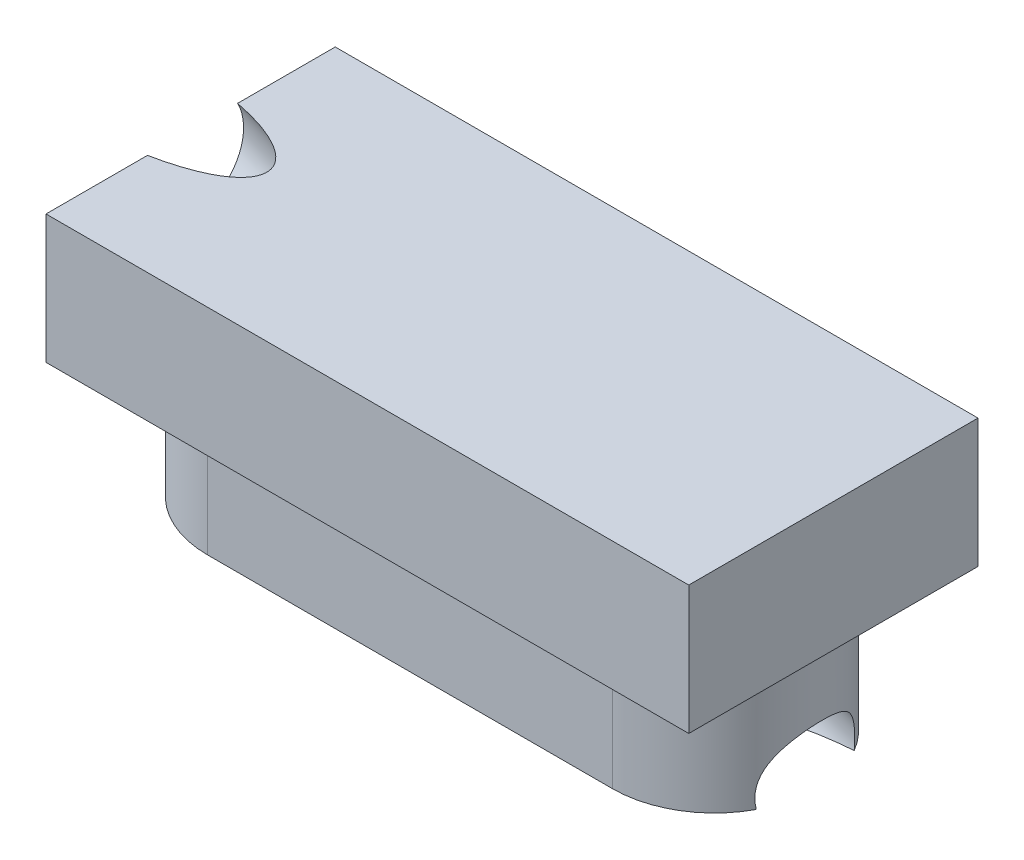
ISO-10303-21;
HEADER;
FILE_DESCRIPTION(('STEP AP214'),'2;1');
FILE_NAME('part.step','',(''),(''),'','','');
FILE_SCHEMA(('AUTOMOTIVE_DESIGN { 1 0 10303 214 1 1 1 1 }'));
ENDSEC;
DATA;
#1=APPLICATION_CONTEXT('core data for automotive mechanical design processes');
#2=APPLICATION_PROTOCOL_DEFINITION('international standard','automotive_design',2000,#1);
#3=PRODUCT_CONTEXT('',#1,'mechanical');
#4=PRODUCT('Part','Part','',(#3));
#5=PRODUCT_RELATED_PRODUCT_CATEGORY('part','',(#4));
#6=PRODUCT_DEFINITION_FORMATION('','',#4);
#7=PRODUCT_DEFINITION_CONTEXT('part definition',#1,'design');
#8=PRODUCT_DEFINITION('design','',#6,#7);
#9=PRODUCT_DEFINITION_SHAPE('','',#8);
#10=(LENGTH_UNIT() NAMED_UNIT(*) SI_UNIT(.MILLI.,.METRE.));
#11=(NAMED_UNIT(*) PLANE_ANGLE_UNIT() SI_UNIT($,.RADIAN.));
#12=(NAMED_UNIT(*) SI_UNIT($,.STERADIAN.) SOLID_ANGLE_UNIT());
#13=UNCERTAINTY_MEASURE_WITH_UNIT(LENGTH_MEASURE(1.E-05),#10,'distance_accuracy_value','');
#14=(GEOMETRIC_REPRESENTATION_CONTEXT(3) GLOBAL_UNCERTAINTY_ASSIGNED_CONTEXT((#13)) GLOBAL_UNIT_ASSIGNED_CONTEXT((#10,
#11,#12)) REPRESENTATION_CONTEXT('',''));
#15=CARTESIAN_POINT('',(0.,0.,0.));
#16=DIRECTION('',(0.,0.,1.));
#17=DIRECTION('',(1.,0.,0.));
#18=AXIS2_PLACEMENT_3D('',#15,#16,#17);
#19=CARTESIAN_POINT('',(1.575,1.,0.0473674614201627));
#20=DIRECTION('',(0.,-1.,0.));
#21=DIRECTION('',(0.,0.,-1.));
#22=AXIS2_PLACEMENT_3D('',#19,#20,#21);
#23=CYLINDRICAL_SURFACE('',#22,0.79375);
#24=CARTESIAN_POINT('',(1.575,0.,0.0473674614201627));
#25=DIRECTION('',(0.,1.,0.));
#26=DIRECTION('',(0.,0.,1.));
#27=AXIS2_PLACEMENT_3D('',#24,#25,#26);
#28=CIRCLE('',#27,0.79375);
#29=CARTESIAN_POINT('',(2.27480655811766,0.,0.421947017343213));
#30=VERTEX_POINT('',#29);
#31=CARTESIAN_POINT('',(1.575,0.,0.841117461420163));
#32=VERTEX_POINT('',#31);
#33=EDGE_CURVE('E162',#30,#32,#28,.F.);
#34=ORIENTED_EDGE('',*,*,#33,.F.);
#35=CARTESIAN_POINT('',(2.27480655811767,0.,0.421947017343207));
#36=CARTESIAN_POINT('',(2.27290475913481,0.0187473128209449,0.42546143543055));
#37=CARTESIAN_POINT('',(2.27166349827804,0.037837291086776,0.427751535409357));
#38=CARTESIAN_POINT('',(2.27064446657195,0.0760438339837114,0.429633152383738));
#39=CARTESIAN_POINT('',(2.27085623642141,0.0951592203780479,0.42924395560214));
#40=CARTESIAN_POINT('',(2.27281131817616,0.132224902451338,0.425653574423875));
#41=CARTESIAN_POINT('',(2.2744881394751,0.150189877215529,0.422574470799065));
#42=CARTESIAN_POINT('',(2.27917356866453,0.185279366072017,0.413706175278667));
#43=CARTESIAN_POINT('',(2.28218369161929,0.202402899351118,0.407913899905822));
#44=CARTESIAN_POINT('',(2.28921393924687,0.235204365328227,0.393775785385924));
#45=CARTESIAN_POINT('',(2.29322788057111,0.250890372928903,0.385445513688793));
#46=CARTESIAN_POINT('',(2.30185345468241,0.280582662940252,0.366477498835634));
#47=CARTESIAN_POINT('',(2.30646454559633,0.294590446307638,0.355841841837072));
#48=CARTESIAN_POINT('',(2.31604451225465,0.321297685499104,0.332082402719911));
#49=CARTESIAN_POINT('',(2.32102029434606,0.3339186939115,0.318873663185869));
#50=CARTESIAN_POINT('',(2.33074604280964,0.357164317092347,0.290501073022927));
#51=CARTESIAN_POINT('',(2.33549327265475,0.367767838674795,0.275319092130322));
#52=CARTESIAN_POINT('',(2.34432576997775,0.386782893190754,0.243455860933043));
#53=CARTESIAN_POINT('',(2.34841059952855,0.395192978212891,0.226773630017191));
#54=CARTESIAN_POINT('',(2.35617095933561,0.410926165070049,0.189581711996557));
#55=CARTESIAN_POINT('',(2.35968448179174,0.417877787828919,0.168879904268659));
#56=CARTESIAN_POINT('',(2.36508418544465,0.428788316687565,0.126503703248674));
#57=CARTESIAN_POINT('',(2.36697044541866,0.432747367659269,0.10482935709149));
#58=CARTESIAN_POINT('',(2.36893403090621,0.437661977984487,0.061062026989856));
#59=CARTESIAN_POINT('',(2.36901138124383,0.438617578554883,0.0389690487945532));
#60=CARTESIAN_POINT('',(2.36732247806588,0.437526045011168,-0.00507109503252541));
#61=CARTESIAN_POINT('',(2.36555624069689,0.435478937195425,-0.0270182619396568));
#62=CARTESIAN_POINT('',(2.36029449591995,0.428397072163708,-0.070212192056974));
#63=CARTESIAN_POINT('',(2.35679898812197,0.423362314273887,-0.0914589551091869));
#64=CARTESIAN_POINT('',(2.34833851499657,0.410325971685298,-0.132716135062642));
#65=CARTESIAN_POINT('',(2.34337348048279,0.402324247295152,-0.152726493699456));
#66=CARTESIAN_POINT('',(2.33237741956,0.383370408374989,-0.190990908106002));
#67=CARTESIAN_POINT('',(2.326346218966,0.372417811592376,-0.20924467613882));
#68=CARTESIAN_POINT('',(2.31410789388113,0.348243596727161,-0.242558303099579));
#69=CARTESIAN_POINT('',(2.30792665673789,0.335171407997486,-0.257735574228023));
#70=CARTESIAN_POINT('',(2.29615039812182,0.307496190639898,-0.284567387189491));
#71=CARTESIAN_POINT('',(2.29054482363793,0.293066681743654,-0.296395101416329));
#72=CARTESIAN_POINT('',(2.28038693915799,0.263218737036272,-0.316761012064746));
#73=CARTESIAN_POINT('',(2.27578933662254,0.247930252087437,-0.325465878091827));
#74=CARTESIAN_POINT('',(2.26778424798577,0.216351818914873,-0.340133956697702));
#75=CARTESIAN_POINT('',(2.26434669172017,0.200102601272871,-0.346167960680717));
#76=CARTESIAN_POINT('',(2.25881134899761,0.166641613912717,-0.355710728113688));
#77=CARTESIAN_POINT('',(2.25671499581061,0.149428835773699,-0.35921679059783));
#78=CARTESIAN_POINT('',(2.25401359167783,0.114623360421782,-0.363712008400114));
#79=CARTESIAN_POINT('',(2.25340422446174,0.0970319126937199,-0.364708448663265));
#80=CARTESIAN_POINT('',(2.25360615723677,0.0618990818263485,-0.364376435078818));
#81=CARTESIAN_POINT('',(2.25441676902625,0.0443576785594358,-0.363049107459924));
#82=CARTESIAN_POINT('',(2.25657688879684,0.0179482410185388,-0.359440764019642));
#83=CARTESIAN_POINT('',(2.25748501253244,0.0089335308918141,-0.357916482100452));
#84=CARTESIAN_POINT('',(2.25854479429263,0.,-0.356124269220565));
#85=B_SPLINE_CURVE_WITH_KNOTS('',3,(#35,#36,#37,#38,#39,#40,#41,#42,#43,#44,#45,#46,#47,#48,#49,
#50,#51,#52,#53,#54,#55,#56,#57,#58,#59,#60,#61,#62,#63,#64,#65,#66,#67,#68,#69,#70,#71,#72,#73,
#74,#75,#76,#77,#78,#79,#80,#81,#82,#83,#84),.UNSPECIFIED.,.F.,.F.,(4,2,2,2,2,2,2,2,2,2,2,2,2,2,
2,2,2,2,2,2,2,2,2,2,4),(0.,0.0575237540739679,0.114633873503813,0.169279312924329,
0.223987007273612,0.27836567242222,0.332695333890509,0.38928026802939,0.446427707580151,
0.503612775842374,0.569676140400476,0.635736306592478,0.701795566225118,0.767854247299928,
0.83391294327386,0.899974749833041,0.966047359239181,1.02864888352726,1.08682544071129,
1.14112573312651,1.19388511875639,1.24670079167714,1.2993629733478,1.35199963902641,
1.37953290455163),.UNSPECIFIED.);
#86=CARTESIAN_POINT('',(2.25854479428757,0.,-0.356124269220179));
#87=VERTEX_POINT('',#86);
#88=EDGE_CURVE('E54',#30,#87,#85,.T.);
#89=ORIENTED_EDGE('',*,*,#88,.T.);
#90=CARTESIAN_POINT('',(1.575,0.,-0.746382538579837));
#91=VERTEX_POINT('',#90);
#92=EDGE_CURVE('E176',#91,#87,#28,.F.);
#93=ORIENTED_EDGE('',*,*,#92,.F.);
#94=DIRECTION('',(0.,-1.,0.));
#95=VECTOR('',#94,1.);
#96=CARTESIAN_POINT('',(1.575,1.,-0.746382538579837));
#97=LINE('',#96,#95);
#98=CARTESIAN_POINT('',(1.575,1.,-0.746382538579837));
#99=VERTEX_POINT('',#98);
#100=EDGE_CURVE('E48',#99,#91,#97,.T.);
#101=ORIENTED_EDGE('',*,*,#100,.F.);
#102=CARTESIAN_POINT('',(1.575,1.,0.0473674614201627));
#103=DIRECTION('',(0.,1.,0.));
#104=DIRECTION('',(0.,0.,1.));
#105=AXIS2_PLACEMENT_3D('',#102,#103,#104);
#106=CIRCLE('',#105,0.79375);
#107=CARTESIAN_POINT('',(1.575,1.,0.841117461420163));
#108=VERTEX_POINT('',#107);
#109=EDGE_CURVE('E163',#99,#108,#106,.F.);
#110=ORIENTED_EDGE('',*,*,#109,.T.);
#111=DIRECTION('',(0.,-1.,0.));
#112=VECTOR('',#111,1.);
#113=CARTESIAN_POINT('',(1.575,1.,0.841117461420163));
#114=LINE('',#113,#112);
#115=EDGE_CURVE('E175',#108,#32,#114,.T.);
#116=ORIENTED_EDGE('',*,*,#115,.T.);
#117=EDGE_LOOP('',(#34,#89,#93,#101,#110,#116));
#118=FACE_BOUND('',#117,.T.);
#119=ADVANCED_FACE('F35',(#118),#23,.T.);
#120=CARTESIAN_POINT('',(0.,0.,0.));
#121=DIRECTION('',(0.,1.,0.));
#122=DIRECTION('',(0.,0.,1.));
#123=AXIS2_PLACEMENT_3D('',#120,#121,#122);
#124=PLANE('',#123);
#125=CARTESIAN_POINT('',(2.397175,0.,0.427982148555704));
#126=CARTESIAN_POINT('',(2.36796450905351,1.22261529916144E-13,0.427148748386135));
#127=CARTESIAN_POINT('',(2.33876709555136,0.,0.425889056421551));
#128=CARTESIAN_POINT('',(2.28042382861932,0.,0.42248610742621));
#129=CARTESIAN_POINT('',(2.25127797543482,-1.19226931686685E-13,0.420342846201577));
#130=CARTESIAN_POINT('',(2.16395771990467,2.65769411504817E-13,0.412541382305574));
#131=CARTESIAN_POINT('',(2.10589917447937,1.27115009376972E-12,0.405511461259729));
#132=CARTESIAN_POINT('',(1.99039801853805,1.25287044279439E-12,0.387279404692884));
#133=CARTESIAN_POINT('',(1.93295555409935,2.2873914278021E-13,0.376076301236728));
#134=CARTESIAN_POINT('',(1.84774408472115,-1.1439148879792E-13,0.355335256521259));
#135=CARTESIAN_POINT('',(1.81949630588881,0.,0.347764596220603));
#136=CARTESIAN_POINT('',(1.76341566469524,0.,0.331056376802049));
#137=CARTESIAN_POINT('',(1.73558355854756,0.,0.321916269014761));
#138=CARTESIAN_POINT('',(1.67528740346927,0.,0.299803934787368));
#139=CARTESIAN_POINT('',(1.64296301083421,0.,0.286432726107921));
#140=CARTESIAN_POINT('',(1.59582924658378,0.,0.263672164128355));
#141=CARTESIAN_POINT('',(1.58036191787709,0.,0.255646375204926));
#142=CARTESIAN_POINT('',(1.55004974499418,0.,0.238502922641947));
#143=CARTESIAN_POINT('',(1.53520441089752,0.,0.229386141024679));
#144=CARTESIAN_POINT('',(1.50883821786853,0.,0.211456138966348));
#145=CARTESIAN_POINT('',(1.49717809835545,0.,0.202849657494356));
#146=CARTESIAN_POINT('',(1.4747761204113,0.,0.184528779307087));
#147=CARTESIAN_POINT('',(1.46403282714351,0.,0.174816171449245));
#148=CARTESIAN_POINT('',(1.44373017543517,0.,0.153888599315258));
#149=CARTESIAN_POINT('',(1.43419267750807,0.,0.142651953515073));
#150=CARTESIAN_POINT('',(1.4173285857979,0.,0.118627559437801));
#151=CARTESIAN_POINT('',(1.4099912996645,0.,0.105847750360428));
#152=CARTESIAN_POINT('',(1.40099049662917,0.,0.084446300698651));
#153=CARTESIAN_POINT('',(1.39823517303411,0.,0.0762862878502934));
#154=CARTESIAN_POINT('',(1.39410918509456,0.,0.0596222678233482));
#155=CARTESIAN_POINT('',(1.39273703491933,0.,0.0511186400013119));
#156=CARTESIAN_POINT('',(1.39152069159979,0.,0.0339668102469565));
#157=CARTESIAN_POINT('',(1.39168240773919,0.,0.0253181774250572));
#158=CARTESIAN_POINT('',(1.39352842668226,0.,0.00818487111951891));
#159=CARTESIAN_POINT('',(1.39521373866125,0.,-0.000299689883744412));
#160=CARTESIAN_POINT('',(1.40039100091115,0.,-0.0184865334547723));
#161=CARTESIAN_POINT('',(1.40416985780337,0.,-0.0281060038313774));
#162=CARTESIAN_POINT('',(1.41323504048155,0.,-0.0466168430313317));
#163=CARTESIAN_POINT('',(1.41852602213019,0.,-0.0555058521967729));
#164=CARTESIAN_POINT('',(1.43365766862999,0.,-0.0775236335558731));
#165=CARTESIAN_POINT('',(1.44434239938719,0.,-0.0900653059893747));
#166=CARTESIAN_POINT('',(1.46740567209993,0.,-0.113456405047001));
#167=CARTESIAN_POINT('',(1.4797883022293,0.,-0.124301607746966));
#168=CARTESIAN_POINT('',(1.50584008538746,0.,-0.144776143042538));
#169=CARTESIAN_POINT('',(1.51952720890731,0.,-0.15438225619172));
#170=CARTESIAN_POINT('',(1.54764835541335,0.,-0.172435968268907));
#171=CARTESIAN_POINT('',(1.56208301132673,0.,-0.180882562605807));
#172=CARTESIAN_POINT('',(1.60290294776473,0.,-0.203025264481425));
#173=CARTESIAN_POINT('',(1.62984517150922,0.,-0.215690219036646));
#174=CARTESIAN_POINT('',(1.68468393348453,0.,-0.238774525928359));
#175=CARTESIAN_POINT('',(1.71258168045355,0.,-0.249190902355673));
#176=CARTESIAN_POINT('',(1.76886155761681,0.,-0.26818383683754));
#177=CARTESIAN_POINT('',(1.79724119619544,-1.23161900021388E-13,-0.276767853084089));
#178=CARTESIAN_POINT('',(1.8544071521976,1.23182195769169E-13,-0.292450806293291));
#179=CARTESIAN_POINT('',(1.88319353586673,4.59749948492913E-13,-0.299549498297851));
#180=CARTESIAN_POINT('',(1.94101743622911,-4.59227081577878E-13,-0.312456375212231));
#181=CARTESIAN_POINT('',(1.9700546300796,-1.71296161331548E-12,-0.318266018615382));
#182=CARTESIAN_POINT('',(2.02834156862742,1.71353121327408E-12,-0.328745808934497));
#183=CARTESIAN_POINT('',(2.0575913807922,6.39573189189326E-12,-0.333415576298739));
#184=CARTESIAN_POINT('',(2.13833274038069,1.10641133346742E-11,-0.344850382083459));
#185=CARTESIAN_POINT('',(2.18997708684558,4.85378419241907E-12,-0.350543023298893));
#186=CARTESIAN_POINT('',(2.29346825874897,-4.85028210048234E-12,-0.359038510049044));
#187=CARTESIAN_POINT('',(2.34531491120986,-8.34597608771984E-12,-0.361843437659409));
#188=CARTESIAN_POINT('',(2.39717499999997,0.,-0.363352699933463));
#189=B_SPLINE_CURVE_WITH_KNOTS('',3,(#125,#126,#127,#128,#129,#130,#131,#132,#133,#134,#135,
#136,#137,#138,#139,#140,#141,#142,#143,#144,#145,#146,#147,#148,#149,#150,#151,#152,#153,#154,
#155,#156,#157,#158,#159,#160,#161,#162,#163,#164,#165,#166,#167,#168,#169,#170,#171,#172,#173,
#174,#175,#176,#177,#178,#179,#180,#181,#182,#183,#184,#185,#186,#187,#188),.UNSPECIFIED.,.F.,
.F.,(4,2,2,2,2,2,2,2,2,2,2,2,2,2,2,2,2,2,2,2,2,2,2,2,2,2,2,2,2,2,2,4),(0.,0.0876616337968697,
0.175323683685893,0.350643448242562,0.526003902114552,0.613700931800332,0.701541745794205,
0.80629122044717,0.85853577339582,0.910738370573763,0.954162892305812,0.9975181581401,
1.0415718516331,1.0854078525895,1.11114567055511,1.13685581091737,1.16266504077312,
1.18849137827357,1.21932460239899,1.25025380478336,1.29940296857978,1.34867262183036,
1.39876163600688,1.44889377636192,1.53804577394707,1.62731504716085,1.71621373366166,
1.80512706970359,1.89393928590445,1.98278103425261,2.13856263680734,2.29423184015507),.UNSPECIFIED.);
#190=EDGE_CURVE('E124',#30,#87,#189,.T.);
#191=ORIENTED_EDGE('',*,*,#190,.F.);
#192=ORIENTED_EDGE('',*,*,#33,.T.);
#193=DIRECTION('',(1.,0.,0.));
#194=VECTOR('',#193,1.);
#195=CARTESIAN_POINT('',(0.,0.,0.841117461420163));
#196=LINE('',#195,#194);
#197=CARTESIAN_POINT('',(-1.575,0.,0.841117461420163));
#198=VERTEX_POINT('',#197);
#199=EDGE_CURVE('E166',#198,#32,#196,.T.);
#200=ORIENTED_EDGE('',*,*,#199,.F.);
#201=CARTESIAN_POINT('',(-1.575,0.,0.0473674614201627));
#202=DIRECTION('',(0.,1.,0.));
#203=DIRECTION('',(0.,0.,1.));
#204=AXIS2_PLACEMENT_3D('',#201,#202,#203);
#205=CIRCLE('',#204,0.79375);
#206=CARTESIAN_POINT('',(-1.575,0.,-0.746382538579837));
#207=VERTEX_POINT('',#206);
#208=EDGE_CURVE('E182',#198,#207,#205,.F.);
#209=ORIENTED_EDGE('',*,*,#208,.T.);
#210=DIRECTION('',(1.,0.,0.));
#211=VECTOR('',#210,1.);
#212=CARTESIAN_POINT('',(0.,0.,-0.746382538579837));
#213=LINE('',#212,#211);
#214=EDGE_CURVE('E179',#207,#91,#213,.T.);
#215=ORIENTED_EDGE('',*,*,#214,.T.);
#216=ORIENTED_EDGE('',*,*,#92,.T.);
#217=EDGE_LOOP('',(#191,#192,#200,#209,#215,#216));
#218=FACE_BOUND('',#217,.T.);
#219=ADVANCED_FACE('F201',(#218),#124,.F.);
#220=CARTESIAN_POINT('',(-2.5,2.,-1.07763253857984));
#221=DIRECTION('',(1.,0.,0.));
#222=DIRECTION('',(0.,0.,-1.));
#223=AXIS2_PLACEMENT_3D('',#220,#221,#222);
#224=PLANE('',#223);
#225=CARTESIAN_POINT('',(-2.5,2.,-0.317936772964535));
#226=CARTESIAN_POINT('',(-2.5,1.98059400012431,-0.328297893178377));
#227=CARTESIAN_POINT('',(-2.5,1.96031609395947,-0.337011695009106));
#228=CARTESIAN_POINT('',(-2.5,1.91860097923725,-0.350979581708868));
#229=CARTESIAN_POINT('',(-2.5,1.89716377067987,-0.3562336665779));
#230=CARTESIAN_POINT('',(-2.5,1.85371456135836,-0.363117039158797));
#231=CARTESIAN_POINT('',(-2.5,1.83170256059423,-0.364746326870662));
#232=CARTESIAN_POINT('',(-2.5,1.78771269830616,-0.364340570471703));
#233=CARTESIAN_POINT('',(-2.5,1.76573483678222,-0.362305526360879));
#234=CARTESIAN_POINT('',(-2.5,1.72241894710352,-0.354625787786488));
#235=CARTESIAN_POINT('',(-2.5,1.70108091894876,-0.348981093322922));
#236=CARTESIAN_POINT('',(-2.5,1.65963335779808,-0.334238130322301));
#237=CARTESIAN_POINT('',(-2.5,1.63952382480217,-0.325139861785246));
#238=CARTESIAN_POINT('',(-2.5,1.60108786736927,-0.303740589292517));
#239=CARTESIAN_POINT('',(-2.5,1.58276144293227,-0.291439585336842));
#240=CARTESIAN_POINT('',(-2.5,1.54839717962613,-0.263974148255288));
#241=CARTESIAN_POINT('',(-2.5,1.53235934075698,-0.248809715129407));
#242=CARTESIAN_POINT('',(-2.5,1.50301459146342,-0.216035667905357));
#243=CARTESIAN_POINT('',(-2.5,1.48970768103901,-0.198426053807187));
#244=CARTESIAN_POINT('',(-2.5,1.46619181196707,-0.161247343711466));
#245=CARTESIAN_POINT('',(-2.5,1.45598285331954,-0.141678247713914));
#246=CARTESIAN_POINT('',(-2.5,1.43894446456698,-0.101120315528838));
#247=CARTESIAN_POINT('',(-2.5,1.43211503446196,-0.0801314793413135));
#248=CARTESIAN_POINT('',(-2.5,1.42202406779837,-0.0373129675276175));
#249=CARTESIAN_POINT('',(-2.5,1.4187625312398,-0.015483291901446));
#250=CARTESIAN_POINT('',(-2.5,1.41589730927084,0.0284148067260627));
#251=CARTESIAN_POINT('',(-2.5,1.41629362386045,0.0504832297273999));
#252=CARTESIAN_POINT('',(-2.5,1.42073317327167,0.0942501460180027));
#253=CARTESIAN_POINT('',(-2.5,1.42477640809329,0.115948639307268));
#254=CARTESIAN_POINT('',(-2.5,1.43639828015317,0.158377222256411));
#255=CARTESIAN_POINT('',(-2.5,1.44397691739143,0.179107311916287));
#256=CARTESIAN_POINT('',(-2.5,1.46246056482905,0.219027323599381));
#257=CARTESIAN_POINT('',(-2.5,1.47336557502841,0.238217245622599));
#258=CARTESIAN_POINT('',(-2.5,1.49820119469471,0.274527637843366));
#259=CARTESIAN_POINT('',(-2.5,1.51213180416166,0.291648108040916));
#260=CARTESIAN_POINT('',(-2.5,1.54263439238862,0.32334739107827));
#261=CARTESIAN_POINT('',(-2.5,1.55920637114862,0.337926203918073));
#262=CARTESIAN_POINT('',(-2.5,1.59453463836486,0.364140067706757));
#263=CARTESIAN_POINT('',(-2.5,1.6132909268211,0.375775118655638));
#264=CARTESIAN_POINT('',(-2.5,1.65247042202832,0.395780552167141));
#265=CARTESIAN_POINT('',(-2.5,1.6728936287793,0.404150934729763));
#266=CARTESIAN_POINT('',(-2.5,1.71484391268046,0.417396149976966));
#267=CARTESIAN_POINT('',(-2.5,1.73637098983063,0.422270982661547));
#268=CARTESIAN_POINT('',(-2.5,1.77993432846075,0.428390699524808));
#269=CARTESIAN_POINT('',(-2.5,1.80197058994069,0.429635583703489));
#270=CARTESIAN_POINT('',(-2.5,1.8459480155054,0.428460859417944));
#271=CARTESIAN_POINT('',(-2.5,1.86788917959017,0.426041250953718));
#272=CARTESIAN_POINT('',(-2.5,1.90851904556333,0.418101254330287));
#273=CARTESIAN_POINT('',(-2.5,1.92728672795575,0.412979111234722));
#274=CARTESIAN_POINT('',(-2.5,1.9642847454032,0.399911928975123));
#275=CARTESIAN_POINT('',(-2.5,1.98249373508707,0.39190643066596));
#276=CARTESIAN_POINT('',(-2.5,1.99999999999999,0.382566221586777));
#277=B_SPLINE_CURVE_WITH_KNOTS('',3,(#225,#226,#227,#228,#229,#230,#231,#232,#233,#234,#235,
#236,#237,#238,#239,#240,#241,#242,#243,#244,#245,#246,#247,#248,#249,#250,#251,#252,#253,#254,
#255,#256,#257,#258,#259,#260,#261,#262,#263,#264,#265,#266,#267,#268,#269,#270,#271,#272,#273,
#274,#275,#276),.UNSPECIFIED.,.F.,.F.,(4,2,2,2,2,2,2,2,2,2,2,2,2,2,2,2,2,2,2,2,2,2,2,2,2,4),(0.,
0.0659115563194932,0.131823112638985,0.197734668958477,0.263646225277969,0.329557781597461,
0.395469337916953,0.461380894236445,0.527292450555936,0.593204006875428,0.65911556319492,
0.725027119514411,0.790938675833903,0.856850232153395,0.922761788472886,0.988673344792378,
1.05458490111187,1.12049645743136,1.18640801375085,1.25231957007034,1.31823112638984,
1.38414268270933,1.45005423902882,1.51596579534831,1.57412380409808,1.6335799862812),.UNSPECIFIED.);
#278=CARTESIAN_POINT('',(-2.5,2.,-0.317936772964535));
#279=VERTEX_POINT('',#278);
#280=CARTESIAN_POINT('',(-2.5,2.,0.382566221591575));
#281=VERTEX_POINT('',#280);
#282=EDGE_CURVE('E61',#279,#281,#277,.T.);
#283=ORIENTED_EDGE('',*,*,#282,.F.);
#284=DIRECTION('',(0.,0.,1.));
#285=VECTOR('',#284,1.);
#286=CARTESIAN_POINT('',(-2.5,2.,-1.07763253857984));
#287=LINE('',#286,#285);
#288=CARTESIAN_POINT('',(-2.5,2.,-1.07763253857984));
#289=VERTEX_POINT('',#288);
#290=EDGE_CURVE('E121',#289,#279,#287,.T.);
#291=ORIENTED_EDGE('',*,*,#290,.F.);
#292=DIRECTION('',(0.,-1.,0.));
#293=VECTOR('',#292,1.);
#294=CARTESIAN_POINT('',(-2.5,2.,-1.07763253857984));
#295=LINE('',#294,#293);
#296=CARTESIAN_POINT('',(-2.5,1.,-1.07763253857984));
#297=VERTEX_POINT('',#296);
#298=EDGE_CURVE('E143',#289,#297,#295,.T.);
#299=ORIENTED_EDGE('',*,*,#298,.T.);
#300=DIRECTION('',(0.,0.,1.));
#301=VECTOR('',#300,1.);
#302=CARTESIAN_POINT('',(-2.5,1.,-1.07763253857984));
#303=LINE('',#302,#301);
#304=CARTESIAN_POINT('',(-2.5,1.,1.17236746142016));
#305=VERTEX_POINT('',#304);
#306=EDGE_CURVE('E144',#297,#305,#303,.T.);
#307=ORIENTED_EDGE('',*,*,#306,.T.);
#308=DIRECTION('',(0.,-1.,0.));
#309=VECTOR('',#308,1.);
#310=CARTESIAN_POINT('',(-2.5,2.,1.17236746142016));
#311=LINE('',#310,#309);
#312=CARTESIAN_POINT('',(-2.5,2.,1.17236746142016));
#313=VERTEX_POINT('',#312);
#314=EDGE_CURVE('E159',#313,#305,#311,.T.);
#315=ORIENTED_EDGE('',*,*,#314,.F.);
#316=EDGE_CURVE('E123',#281,#313,#287,.T.);
#317=ORIENTED_EDGE('',*,*,#316,.F.);
#318=EDGE_LOOP('',(#283,#291,#299,#307,#315,#317));
#319=FACE_BOUND('',#318,.T.);
#320=ADVANCED_FACE('F119',(#319),#224,.F.);
#321=CARTESIAN_POINT('',(0.,2.,0.));
#322=DIRECTION('',(0.,1.,0.));
#323=DIRECTION('',(0.,0.,1.));
#324=AXIS2_PLACEMENT_3D('',#321,#322,#323);
#325=PLANE('',#324);
#326=ORIENTED_EDGE('',*,*,#290,.T.);
#327=CARTESIAN_POINT('',(-2.5,2.,-0.317936772964535));
#328=CARTESIAN_POINT('',(-2.47127729535429,2.,-0.312357588162685));
#329=CARTESIAN_POINT('',(-2.44266563125951,2.,-0.30621712707801));
#330=CARTESIAN_POINT('',(-2.38578661849369,2.,-0.292623503689121));
#331=CARTESIAN_POINT('',(-2.35751896544523,2.,-0.285171608166973));
#332=CARTESIAN_POINT('',(-2.2841892239013,2.,-0.263722336655962));
#333=CARTESIAN_POINT('',(-2.23945637582542,1.99999999999999,-0.248513080223905));
#334=CARTESIAN_POINT('',(-2.16774008633411,2.00000000000001,-0.218974357714848));
#335=CARTESIAN_POINT('',(-2.14009789735838,2.00000000000002,-0.206252733236482));
#336=CARTESIAN_POINT('',(-2.08642732548051,1.99999999999998,-0.177759668939709));
#337=CARTESIAN_POINT('',(-2.06039510753733,1.99999999999994,-0.161995876835474));
#338=CARTESIAN_POINT('',(-2.02442408501774,1.99999999999997,-0.135579621193512));
#339=CARTESIAN_POINT('',(-2.01325564908913,1.99999999999999,-0.126633511189538));
#340=CARTESIAN_POINT('',(-1.99196954524506,2.00000000000001,-0.107582070602844));
#341=CARTESIAN_POINT('',(-1.98185247501711,2.,-0.0974760874426464));
#342=CARTESIAN_POINT('',(-1.95705072751683,2.,-0.0687099256903317));
#343=CARTESIAN_POINT('',(-1.94365324928329,2.,-0.048749538622725));
#344=CARTESIAN_POINT('',(-1.93131005139871,2.,-0.0190151209528794));
#345=CARTESIAN_POINT('',(-1.92858826410927,2.,-0.0108129860102212));
#346=CARTESIAN_POINT('',(-1.92454625779649,2.,0.00593051395953294));
#347=CARTESIAN_POINT('',(-1.92322443918998,2.,0.0144714802368244));
#348=CARTESIAN_POINT('',(-1.9221220114003,2.,0.0316865913453196));
#349=CARTESIAN_POINT('',(-1.92234709612814,2.00000000000001,0.0403611108060153));
#350=CARTESIAN_POINT('',(-1.92432490768219,1.99999999999999,0.0575348316649135));
#351=CARTESIAN_POINT('',(-1.92607879497096,1.99999999999995,0.066033894862259));
#352=CARTESIAN_POINT('',(-1.9314164021547,1.99999999999994,0.0842815233120808));
#353=CARTESIAN_POINT('',(-1.9352944805615,1.99999999999998,0.0939427749181369));
#354=CARTESIAN_POINT('',(-1.94456089041985,2.00000000000002,0.112522440596315));
#355=CARTESIAN_POINT('',(-1.94995394535586,2.00000000000001,0.121438416341535));
#356=CARTESIAN_POINT('',(-1.96539798863781,1.99999999999999,0.143586733466623));
#357=CARTESIAN_POINT('',(-1.9763064249225,2.,0.156213934410769));
#358=CARTESIAN_POINT('',(-1.99982864633503,2.,0.179754216694935));
#359=CARTESIAN_POINT('',(-2.01244746471138,2.,0.190662025244814));
#360=CARTESIAN_POINT('',(-2.03917679554346,2.,0.211398983027432));
#361=CARTESIAN_POINT('',(-2.05332201283921,2.,0.221182724215826));
#362=CARTESIAN_POINT('',(-2.08237749953529,2.,0.239545602315389));
#363=CARTESIAN_POINT('',(-2.09728847357608,2.00000000000001,0.248123601581907));
#364=CARTESIAN_POINT('',(-2.14283357411209,1.99999999999999,0.272395171466601));
#365=CARTESIAN_POINT('',(-2.17425490326738,1.99999999999993,0.286608534120867));
#366=CARTESIAN_POINT('',(-2.22979486437923,2.00000000000004,0.308817190840672));
#367=CARTESIAN_POINT('',(-2.25366671972914,2.00000000000016,0.317465526420381));
#368=CARTESIAN_POINT('',(-2.30179745417342,1.99999999999984,0.333453603045437));
#369=CARTESIAN_POINT('',(-2.32605553120426,1.9999999999994,0.340795747116761));
#370=CARTESIAN_POINT('',(-2.37511488946673,2.0000000000006,0.354449226489593));
#371=CARTESIAN_POINT('',(-2.39991917321888,2.00000000000225,0.360749592896928));
#372=CARTESIAN_POINT('',(-2.44978926639505,1.99999999999775,0.372366649740822));
#373=CARTESIAN_POINT('',(-2.47485535295878,1.99999999999158,0.377682155501469));
#374=CARTESIAN_POINT('',(-2.49999999999254,1.99999999997654,0.382566221591575));
#375=B_SPLINE_CURVE_WITH_KNOTS('',3,(#327,#328,#329,#330,#331,#332,#333,#334,#335,#336,#337,
#338,#339,#340,#341,#342,#343,#344,#345,#346,#347,#348,#349,#350,#351,#352,#353,#354,#355,#356,
#357,#358,#359,#360,#361,#362,#363,#364,#365,#366,#367,#368,#369,#370,#371,#372,#373,#374),
.UNSPECIFIED.,.F.,.F.,(4,2,2,2,2,2,2,2,2,2,2,2,2,2,2,2,2,2,2,2,2,2,2,4),(0.,0.0877637889365405,
0.175443263022218,0.316880667414951,0.408059042315635,0.499011121183926,0.541858271794959,
0.584729648708066,0.655375706608949,0.681200192342079,0.706995139468823,0.732885084511163,
0.758794698869592,0.789852947163894,0.821009126508685,0.87078657718109,0.920713827015326,
0.972230911182377,1.02379628120619,1.12701819784221,1.20315999101428,1.2791602224938,
1.35591571703465,1.43276294868972),.UNSPECIFIED.);
#376=EDGE_CURVE('E11',#279,#281,#375,.T.);
#377=ORIENTED_EDGE('',*,*,#376,.T.);
#378=ORIENTED_EDGE('',*,*,#316,.T.);
#379=DIRECTION('',(1.,0.,0.));
#380=VECTOR('',#379,1.);
#381=CARTESIAN_POINT('',(-2.5,2.,1.17236746142016));
#382=LINE('',#381,#380);
#383=CARTESIAN_POINT('',(2.5,2.,1.17236746142016));
#384=VERTEX_POINT('',#383);
#385=EDGE_CURVE('E130',#313,#384,#382,.T.);
#386=ORIENTED_EDGE('',*,*,#385,.T.);
#387=DIRECTION('',(0.,0.,-1.));
#388=VECTOR('',#387,1.);
#389=CARTESIAN_POINT('',(2.5,2.,-1.07763253857984));
#390=LINE('',#389,#388);
#391=CARTESIAN_POINT('',(2.5,2.,-1.07763253857984));
#392=VERTEX_POINT('',#391);
#393=EDGE_CURVE('E132',#384,#392,#390,.T.);
#394=ORIENTED_EDGE('',*,*,#393,.T.);
#395=DIRECTION('',(-1.,0.,0.));
#396=VECTOR('',#395,1.);
#397=CARTESIAN_POINT('',(-2.5,2.,-1.07763253857984));
#398=LINE('',#397,#396);
#399=EDGE_CURVE('E128',#392,#289,#398,.T.);
#400=ORIENTED_EDGE('',*,*,#399,.T.);
#401=EDGE_LOOP('',(#326,#377,#378,#386,#394,#400));
#402=FACE_BOUND('',#401,.T.);
#403=ADVANCED_FACE('F126',(#402),#325,.T.);
#404=CARTESIAN_POINT('',(0.,1.,-0.746382538579837));
#405=DIRECTION('',(0.,0.,-1.));
#406=DIRECTION('',(-1.,0.,0.));
#407=AXIS2_PLACEMENT_3D('',#404,#405,#406);
#408=PLANE('',#407);
#409=ORIENTED_EDGE('',*,*,#214,.F.);
#410=DIRECTION('',(0.,-1.,0.));
#411=VECTOR('',#410,1.);
#412=CARTESIAN_POINT('',(-1.575,1.,-0.746382538579837));
#413=LINE('',#412,#411);
#414=CARTESIAN_POINT('',(-1.575,1.,-0.746382538579837));
#415=VERTEX_POINT('',#414);
#416=EDGE_CURVE('E191',#415,#207,#413,.T.);
#417=ORIENTED_EDGE('',*,*,#416,.F.);
#418=DIRECTION('',(1.,0.,0.));
#419=VECTOR('',#418,1.);
#420=CARTESIAN_POINT('',(0.,1.,-0.746382538579837));
#421=LINE('',#420,#419);
#422=EDGE_CURVE('E165',#415,#99,#421,.T.);
#423=ORIENTED_EDGE('',*,*,#422,.T.);
#424=ORIENTED_EDGE('',*,*,#100,.T.);
#425=EDGE_LOOP('',(#409,#417,#423,#424));
#426=FACE_BOUND('',#425,.T.);
#427=ADVANCED_FACE('F195',(#426),#408,.T.);
#428=CARTESIAN_POINT('',(-1.575,1.,0.0473674614201627));
#429=DIRECTION('',(0.,-1.,0.));
#430=DIRECTION('',(0.,0.,-1.));
#431=AXIS2_PLACEMENT_3D('',#428,#429,#430);
#432=CYLINDRICAL_SURFACE('',#431,0.79375);
#433=ORIENTED_EDGE('',*,*,#208,.F.);
#434=DIRECTION('',(0.,-1.,0.));
#435=VECTOR('',#434,1.);
#436=CARTESIAN_POINT('',(-1.575,1.,0.841117461420163));
#437=LINE('',#436,#435);
#438=CARTESIAN_POINT('',(-1.575,1.,0.841117461420163));
#439=VERTEX_POINT('',#438);
#440=EDGE_CURVE('E189',#439,#198,#437,.T.);
#441=ORIENTED_EDGE('',*,*,#440,.F.);
#442=CARTESIAN_POINT('',(-1.575,1.,0.0473674614201627));
#443=DIRECTION('',(0.,1.,0.));
#444=DIRECTION('',(0.,0.,1.));
#445=AXIS2_PLACEMENT_3D('',#442,#443,#444);
#446=CIRCLE('',#445,0.79375);
#447=EDGE_CURVE('E169',#439,#415,#446,.F.);
#448=ORIENTED_EDGE('',*,*,#447,.T.);
#449=ORIENTED_EDGE('',*,*,#416,.T.);
#450=EDGE_LOOP('',(#433,#441,#448,#449));
#451=FACE_BOUND('',#450,.T.);
#452=ADVANCED_FACE('F205',(#451),#432,.T.);
#453=CARTESIAN_POINT('',(0.,1.,0.841117461420163));
#454=DIRECTION('',(0.,0.,-1.));
#455=DIRECTION('',(-1.,0.,0.));
#456=AXIS2_PLACEMENT_3D('',#453,#454,#455);
#457=PLANE('',#456);
#458=ORIENTED_EDGE('',*,*,#199,.T.);
#459=ORIENTED_EDGE('',*,*,#115,.F.);
#460=DIRECTION('',(1.,0.,0.));
#461=VECTOR('',#460,1.);
#462=CARTESIAN_POINT('',(0.,1.,0.841117461420163));
#463=LINE('',#462,#461);
#464=EDGE_CURVE('E172',#439,#108,#463,.T.);
#465=ORIENTED_EDGE('',*,*,#464,.F.);
#466=ORIENTED_EDGE('',*,*,#440,.T.);
#467=EDGE_LOOP('',(#458,#459,#465,#466));
#468=FACE_BOUND('',#467,.T.);
#469=ADVANCED_FACE('F213',(#468),#457,.F.);
#470=CARTESIAN_POINT('',(-2.5,2.,1.17236746142016));
#471=DIRECTION('',(0.,0.,-1.));
#472=DIRECTION('',(-1.,0.,0.));
#473=AXIS2_PLACEMENT_3D('',#470,#471,#472);
#474=PLANE('',#473);
#475=DIRECTION('',(1.,0.,0.));
#476=VECTOR('',#475,1.);
#477=CARTESIAN_POINT('',(-2.5,1.,1.17236746142016));
#478=LINE('',#477,#476);
#479=CARTESIAN_POINT('',(2.5,1.,1.17236746142016));
#480=VERTEX_POINT('',#479);
#481=EDGE_CURVE('E147',#305,#480,#478,.T.);
#482=ORIENTED_EDGE('',*,*,#481,.T.);
#483=DIRECTION('',(0.,-1.,0.));
#484=VECTOR('',#483,1.);
#485=CARTESIAN_POINT('',(2.5,2.,1.17236746142016));
#486=LINE('',#485,#484);
#487=EDGE_CURVE('E156',#384,#480,#486,.T.);
#488=ORIENTED_EDGE('',*,*,#487,.F.);
#489=ORIENTED_EDGE('',*,*,#385,.F.);
#490=ORIENTED_EDGE('',*,*,#314,.T.);
#491=EDGE_LOOP('',(#482,#488,#489,#490));
#492=FACE_BOUND('',#491,.T.);
#493=ADVANCED_FACE('F215',(#492),#474,.F.);
#494=CARTESIAN_POINT('',(2.5,2.,-1.07763253857984));
#495=DIRECTION('',(-1.,0.,0.));
#496=DIRECTION('',(0.,0.,1.));
#497=AXIS2_PLACEMENT_3D('',#494,#495,#496);
#498=PLANE('',#497);
#499=DIRECTION('',(0.,0.,-1.));
#500=VECTOR('',#499,1.);
#501=CARTESIAN_POINT('',(2.5,1.,-1.07763253857984));
#502=LINE('',#501,#500);
#503=CARTESIAN_POINT('',(2.5,1.,-1.07763253857984));
#504=VERTEX_POINT('',#503);
#505=EDGE_CURVE('E149',#480,#504,#502,.T.);
#506=ORIENTED_EDGE('',*,*,#505,.T.);
#507=DIRECTION('',(0.,-1.,0.));
#508=VECTOR('',#507,1.);
#509=CARTESIAN_POINT('',(2.5,2.,-1.07763253857984));
#510=LINE('',#509,#508);
#511=EDGE_CURVE('E153',#392,#504,#510,.T.);
#512=ORIENTED_EDGE('',*,*,#511,.F.);
#513=ORIENTED_EDGE('',*,*,#393,.F.);
#514=ORIENTED_EDGE('',*,*,#487,.T.);
#515=EDGE_LOOP('',(#506,#512,#513,#514));
#516=FACE_BOUND('',#515,.T.);
#517=ADVANCED_FACE('F221',(#516),#498,.F.);
#518=CARTESIAN_POINT('',(-2.5,2.,-1.07763253857984));
#519=DIRECTION('',(0.,0.,1.));
#520=DIRECTION('',(1.,0.,0.));
#521=AXIS2_PLACEMENT_3D('',#518,#519,#520);
#522=PLANE('',#521);
#523=DIRECTION('',(-1.,0.,0.));
#524=VECTOR('',#523,1.);
#525=CARTESIAN_POINT('',(-2.5,1.,-1.07763253857984));
#526=LINE('',#525,#524);
#527=EDGE_CURVE('E134',#504,#297,#526,.T.);
#528=ORIENTED_EDGE('',*,*,#527,.T.);
#529=ORIENTED_EDGE('',*,*,#298,.F.);
#530=ORIENTED_EDGE('',*,*,#399,.F.);
#531=ORIENTED_EDGE('',*,*,#511,.T.);
#532=EDGE_LOOP('',(#528,#529,#530,#531));
#533=FACE_BOUND('',#532,.T.);
#534=ADVANCED_FACE('F254',(#533),#522,.F.);
#535=CARTESIAN_POINT('',(0.,1.,0.));
#536=DIRECTION('',(0.,1.,0.));
#537=DIRECTION('',(0.,0.,1.));
#538=AXIS2_PLACEMENT_3D('',#535,#536,#537);
#539=PLANE('',#538);
#540=ORIENTED_EDGE('',*,*,#109,.F.);
#541=ORIENTED_EDGE('',*,*,#422,.F.);
#542=ORIENTED_EDGE('',*,*,#447,.F.);
#543=ORIENTED_EDGE('',*,*,#464,.T.);
#544=EDGE_LOOP('',(#540,#541,#542,#543));
#545=FACE_BOUND('',#544,.T.);
#546=ORIENTED_EDGE('',*,*,#306,.F.);
#547=ORIENTED_EDGE('',*,*,#527,.F.);
#548=ORIENTED_EDGE('',*,*,#505,.F.);
#549=ORIENTED_EDGE('',*,*,#481,.F.);
#550=EDGE_LOOP('',(#546,#547,#548,#549));
#551=FACE_BOUND('',#550,.T.);
#552=ADVANCED_FACE('F209',(#545,#551),#539,.F.);
#553=CARTESIAN_POINT('',(-2.86763170788278,1.94716923663604,0.0323147243111206));
#554=DIRECTION('',(-1.,0.,0.));
#555=DIRECTION('',(0.,0.,1.));
#556=AXIS2_PLACEMENT_3D('',#553,#554,#555);
#557=CIRCLE('',#556,0.396875);
#558=DIRECTION('',(0.93969262078591,-0.342020143325663,0.));
#559=VECTOR('',#558,1.);
#560=SURFACE_OF_LINEAR_EXTRUSION('',#557,#559);
#561=ORIENTED_EDGE('',*,*,#190,.T.);
#562=ORIENTED_EDGE('',*,*,#88,.F.);
#563=EDGE_LOOP('',(#561,#562));
#564=FACE_BOUND('',#563,.T.);
#565=ORIENTED_EDGE('',*,*,#282,.T.);
#566=ORIENTED_EDGE('',*,*,#376,.F.);
#567=EDGE_LOOP('',(#565,#566));
#568=FACE_BOUND('',#567,.T.);
#569=ADVANCED_FACE('F113',(#564,#568),#560,.T.);
#570=CLOSED_SHELL('',(#119,#219,#320,#403,#427,#452,#469,#493,#517,#534,#552,#569));
#571=MANIFOLD_SOLID_BREP('B2',#570);
#572=ADVANCED_BREP_SHAPE_REPRESENTATION('',(#18,#571),#14);
#573=SHAPE_DEFINITION_REPRESENTATION(#9,#572);
ENDSEC;
END-ISO-10303-21;
